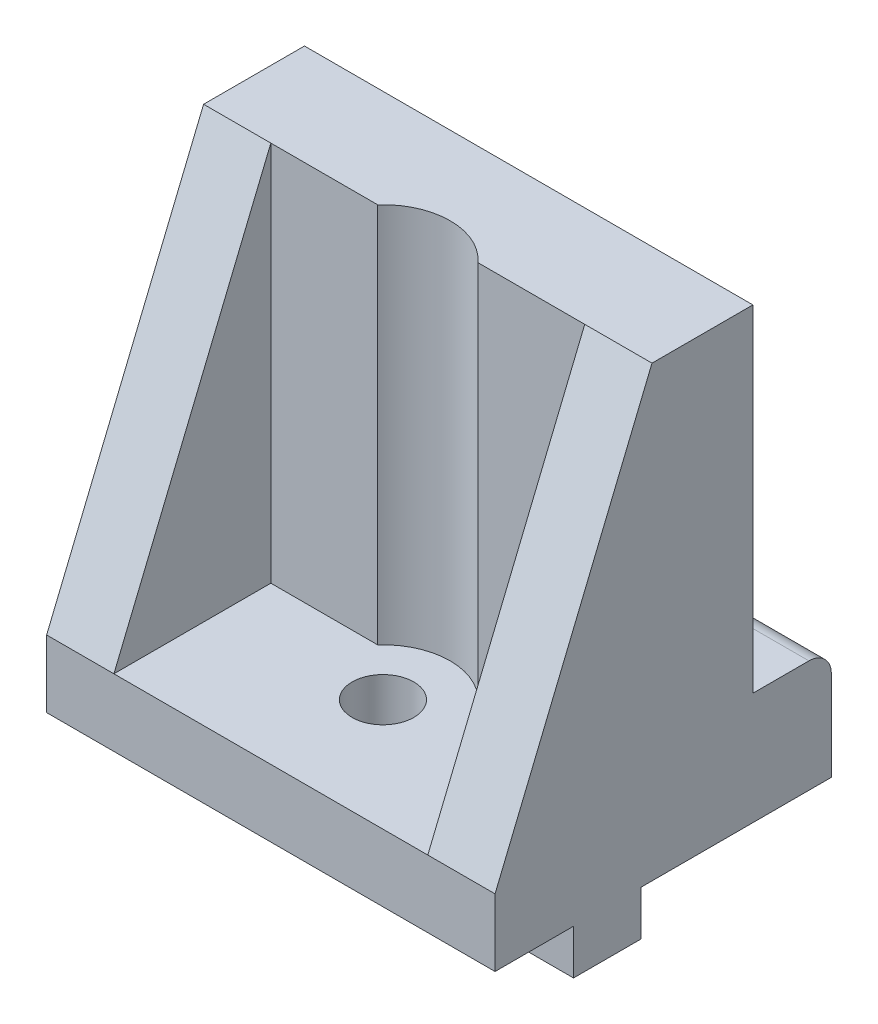
ISO-10303-21;
HEADER;
FILE_DESCRIPTION(('STEP AP214'),'2;1');
FILE_NAME('part.step','',(''),(''),'','','');
FILE_SCHEMA(('AUTOMOTIVE_DESIGN { 1 0 10303 214 1 1 1 1 }'));
ENDSEC;
DATA;
#1=APPLICATION_CONTEXT('core data for automotive mechanical design processes');
#2=APPLICATION_PROTOCOL_DEFINITION('international standard','automotive_design',2000,#1);
#3=PRODUCT_CONTEXT('',#1,'mechanical');
#4=PRODUCT('Part','Part','',(#3));
#5=PRODUCT_RELATED_PRODUCT_CATEGORY('part','',(#4));
#6=PRODUCT_DEFINITION_FORMATION('','',#4);
#7=PRODUCT_DEFINITION_CONTEXT('part definition',#1,'design');
#8=PRODUCT_DEFINITION('design','',#6,#7);
#9=PRODUCT_DEFINITION_SHAPE('','',#8);
#10=(LENGTH_UNIT() NAMED_UNIT(*) SI_UNIT(.MILLI.,.METRE.));
#11=(NAMED_UNIT(*) PLANE_ANGLE_UNIT() SI_UNIT($,.RADIAN.));
#12=(NAMED_UNIT(*) SI_UNIT($,.STERADIAN.) SOLID_ANGLE_UNIT());
#13=UNCERTAINTY_MEASURE_WITH_UNIT(LENGTH_MEASURE(1.E-05),#10,'distance_accuracy_value','');
#14=(GEOMETRIC_REPRESENTATION_CONTEXT(3) GLOBAL_UNCERTAINTY_ASSIGNED_CONTEXT((#13)) GLOBAL_UNIT_ASSIGNED_CONTEXT((#10,
#11,#12)) REPRESENTATION_CONTEXT('',''));
#15=CARTESIAN_POINT('',(0.,0.,0.));
#16=DIRECTION('',(0.,0.,1.));
#17=DIRECTION('',(1.,0.,0.));
#18=AXIS2_PLACEMENT_3D('',#15,#16,#17);
#19=CARTESIAN_POINT('',(6.,-34.,6.));
#20=DIRECTION('',(0.,0.,-1.));
#21=DIRECTION('',(-1.,0.,0.));
#22=AXIS2_PLACEMENT_3D('',#19,#20,#21);
#23=PLANE('',#22);
#24=DIRECTION('',(0.,-1.,0.));
#25=VECTOR('',#24,1.);
#26=CARTESIAN_POINT('',(24.4721359549996,16.9705627484771,6.));
#27=LINE('',#26,#25);
#28=CARTESIAN_POINT('',(24.4721359549996,-34.,6.));
#29=VERTEX_POINT('',#28);
#30=CARTESIAN_POINT('',(24.4721359549996,0.,6.));
#31=VERTEX_POINT('',#30);
#32=EDGE_CURVE('E272',#29,#31,#27,.F.);
#33=ORIENTED_EDGE('',*,*,#32,.F.);
#34=DIRECTION('',(-1.,0.,0.));
#35=VECTOR('',#34,1.);
#36=CARTESIAN_POINT('',(6.,-34.,6.));
#37=LINE('',#36,#35);
#38=CARTESIAN_POINT('',(34.,-34.,6.));
#39=VERTEX_POINT('',#38);
#40=EDGE_CURVE('E332',#39,#29,#37,.T.);
#41=ORIENTED_EDGE('',*,*,#40,.F.);
#42=DIRECTION('',(0.,1.,0.));
#43=VECTOR('',#42,1.);
#44=CARTESIAN_POINT('',(34.,-34.,6.));
#45=LINE('',#44,#43);
#46=CARTESIAN_POINT('',(34.,0.,6.));
#47=VERTEX_POINT('',#46);
#48=EDGE_CURVE('E335',#39,#47,#45,.T.);
#49=ORIENTED_EDGE('',*,*,#48,.T.);
#50=DIRECTION('',(-1.,0.,0.));
#51=VECTOR('',#50,1.);
#52=CARTESIAN_POINT('',(6.,0.,6.));
#53=LINE('',#52,#51);
#54=EDGE_CURVE('E325',#47,#31,#53,.T.);
#55=ORIENTED_EDGE('',*,*,#54,.T.);
#56=EDGE_LOOP('',(#33,#41,#49,#55));
#57=FACE_BOUND('',#56,.T.);
#58=ADVANCED_FACE('F39',(#57),#23,.F.);
#59=DIRECTION('',(0.,-1.,0.));
#60=VECTOR('',#59,1.);
#61=CARTESIAN_POINT('',(15.5278640450004,16.9705627484771,6.));
#62=LINE('',#61,#60);
#63=CARTESIAN_POINT('',(15.5278640450004,0.,6.));
#64=VERTEX_POINT('',#63);
#65=CARTESIAN_POINT('',(15.5278640450004,-34.,6.));
#66=VERTEX_POINT('',#65);
#67=EDGE_CURVE('E270',#64,#66,#62,.T.);
#68=ORIENTED_EDGE('',*,*,#67,.F.);
#69=CARTESIAN_POINT('',(6.00000000000003,0.,6.));
#70=VERTEX_POINT('',#69);
#71=EDGE_CURVE('E320',#64,#70,#53,.T.);
#72=ORIENTED_EDGE('',*,*,#71,.T.);
#73=DIRECTION('',(0.,1.,0.));
#74=VECTOR('',#73,1.);
#75=CARTESIAN_POINT('',(6.,-34.,6.));
#76=LINE('',#75,#74);
#77=CARTESIAN_POINT('',(6.,-34.,6.));
#78=VERTEX_POINT('',#77);
#79=EDGE_CURVE('E338',#78,#70,#76,.T.);
#80=ORIENTED_EDGE('',*,*,#79,.F.);
#81=EDGE_CURVE('E331',#66,#78,#37,.T.);
#82=ORIENTED_EDGE('',*,*,#81,.F.);
#83=EDGE_LOOP('',(#68,#72,#80,#82));
#84=FACE_BOUND('',#83,.T.);
#85=ADVANCED_FACE('F432',(#84),#23,.F.);
#86=CARTESIAN_POINT('',(0.,-40.,20.));
#87=DIRECTION('',(0.,1.,0.));
#88=DIRECTION('',(0.,0.,1.));
#89=AXIS2_PLACEMENT_3D('',#86,#87,#88);
#90=PLANE('',#89);
#91=DIRECTION('',(-1.,0.,0.));
#92=VECTOR('',#91,1.);
#93=CARTESIAN_POINT('',(0.,-40.,13.));
#94=LINE('',#93,#92);
#95=CARTESIAN_POINT('',(40.,-40.,13.));
#96=VERTEX_POINT('',#95);
#97=CARTESIAN_POINT('',(0.,-40.,13.));
#98=VERTEX_POINT('',#97);
#99=EDGE_CURVE('E285',#96,#98,#94,.T.);
#100=ORIENTED_EDGE('',*,*,#99,.F.);
#101=DIRECTION('',(0.,0.,-1.));
#102=VECTOR('',#101,1.);
#103=CARTESIAN_POINT('',(40.,-40.,20.));
#104=LINE('',#103,#102);
#105=CARTESIAN_POINT('',(40.,-40.,20.));
#106=VERTEX_POINT('',#105);
#107=EDGE_CURVE('E351',#106,#96,#104,.T.);
#108=ORIENTED_EDGE('',*,*,#107,.F.);
#109=DIRECTION('',(1.,0.,0.));
#110=VECTOR('',#109,1.);
#111=CARTESIAN_POINT('',(0.,-40.,20.));
#112=LINE('',#111,#110);
#113=CARTESIAN_POINT('',(0.,-40.,20.));
#114=VERTEX_POINT('',#113);
#115=EDGE_CURVE('E345',#114,#106,#112,.T.);
#116=ORIENTED_EDGE('',*,*,#115,.F.);
#117=DIRECTION('',(0.,0.,-1.));
#118=VECTOR('',#117,1.);
#119=CARTESIAN_POINT('',(0.,-40.,20.));
#120=LINE('',#119,#118);
#121=EDGE_CURVE('E355',#114,#98,#120,.T.);
#122=ORIENTED_EDGE('',*,*,#121,.T.);
#123=EDGE_LOOP('',(#100,#108,#116,#122));
#124=FACE_BOUND('',#123,.T.);
#125=ADVANCED_FACE('F401',(#124),#90,.F.);
#126=DIRECTION('',(1.,0.,0.));
#127=VECTOR('',#126,1.);
#128=CARTESIAN_POINT('',(0.,-40.,7.));
#129=LINE('',#128,#127);
#130=CARTESIAN_POINT('',(0.,-40.,7.));
#131=VERTEX_POINT('',#130);
#132=CARTESIAN_POINT('',(40.,-40.,7.));
#133=VERTEX_POINT('',#132);
#134=EDGE_CURVE('E280',#131,#133,#129,.T.);
#135=ORIENTED_EDGE('',*,*,#134,.F.);
#136=CARTESIAN_POINT('',(0.,-40.,-10.));
#137=VERTEX_POINT('',#136);
#138=EDGE_CURVE('E354',#131,#137,#120,.T.);
#139=ORIENTED_EDGE('',*,*,#138,.T.);
#140=DIRECTION('',(-1.,0.,0.));
#141=VECTOR('',#140,1.);
#142=CARTESIAN_POINT('',(81.2310562561766,-40.,-10.));
#143=LINE('',#142,#141);
#144=CARTESIAN_POINT('',(40.,-40.,-10.));
#145=VERTEX_POINT('',#144);
#146=EDGE_CURVE('E228',#145,#137,#143,.T.);
#147=ORIENTED_EDGE('',*,*,#146,.F.);
#148=EDGE_CURVE('E350',#133,#145,#104,.T.);
#149=ORIENTED_EDGE('',*,*,#148,.F.);
#150=EDGE_LOOP('',(#135,#139,#147,#149));
#151=FACE_BOUND('',#150,.T.);
#152=ADVANCED_FACE('F417',(#151),#90,.F.);
#153=CARTESIAN_POINT('',(0.,0.,20.));
#154=DIRECTION('',(1.,0.,0.));
#155=DIRECTION('',(0.,1.,0.));
#156=AXIS2_PLACEMENT_3D('',#153,#154,#155);
#157=PLANE('',#156);
#158=DIRECTION('',(0.,0.,-1.));
#159=VECTOR('',#158,1.);
#160=CARTESIAN_POINT('',(0.,-30.,-10.));
#161=LINE('',#160,#159);
#162=CARTESIAN_POINT('',(0.,-30.,-3.));
#163=VERTEX_POINT('',#162);
#164=CARTESIAN_POINT('',(0.,-30.,-8.));
#165=VERTEX_POINT('',#164);
#166=EDGE_CURVE('E220',#163,#165,#161,.T.);
#167=ORIENTED_EDGE('',*,*,#166,.T.);
#168=CARTESIAN_POINT('',(0.,-32.,-8.));
#169=DIRECTION('',(1.,0.,0.));
#170=DIRECTION('',(0.,1.,0.));
#171=AXIS2_PLACEMENT_3D('',#168,#169,#170);
#172=CIRCLE('',#171,2.);
#173=CARTESIAN_POINT('',(0.,-32.,-10.));
#174=VERTEX_POINT('',#173);
#175=EDGE_CURVE('E61',#165,#174,#172,.F.);
#176=ORIENTED_EDGE('',*,*,#175,.T.);
#177=DIRECTION('',(0.,-1.,0.));
#178=VECTOR('',#177,1.);
#179=CARTESIAN_POINT('',(0.,-40.,-10.));
#180=LINE('',#179,#178);
#181=EDGE_CURVE('E215',#174,#137,#180,.T.);
#182=ORIENTED_EDGE('',*,*,#181,.T.);
#183=ORIENTED_EDGE('',*,*,#138,.F.);
#184=DIRECTION('',(0.,1.,0.));
#185=VECTOR('',#184,1.);
#186=CARTESIAN_POINT('',(0.,-41.,7.));
#187=LINE('',#186,#185);
#188=CARTESIAN_POINT('',(0.,-44.,7.));
#189=VERTEX_POINT('',#188);
#190=EDGE_CURVE('E301',#189,#131,#187,.T.);
#191=ORIENTED_EDGE('',*,*,#190,.F.);
#192=DIRECTION('',(0.,0.,-1.));
#193=VECTOR('',#192,1.);
#194=CARTESIAN_POINT('',(0.,-44.,13.));
#195=LINE('',#194,#193);
#196=CARTESIAN_POINT('',(0.,-44.,13.));
#197=VERTEX_POINT('',#196);
#198=EDGE_CURVE('E233',#197,#189,#195,.T.);
#199=ORIENTED_EDGE('',*,*,#198,.F.);
#200=DIRECTION('',(0.,1.,0.));
#201=VECTOR('',#200,1.);
#202=CARTESIAN_POINT('',(0.,-41.,13.));
#203=LINE('',#202,#201);
#204=EDGE_CURVE('E288',#197,#98,#203,.T.);
#205=ORIENTED_EDGE('',*,*,#204,.T.);
#206=ORIENTED_EDGE('',*,*,#121,.F.);
#207=DIRECTION('',(0.,-1.,0.));
#208=VECTOR('',#207,1.);
#209=CARTESIAN_POINT('',(0.,0.,20.));
#210=LINE('',#209,#208);
#211=CARTESIAN_POINT('',(0.,-34.,20.));
#212=VERTEX_POINT('',#211);
#213=EDGE_CURVE('E341',#212,#114,#210,.T.);
#214=ORIENTED_EDGE('',*,*,#213,.F.);
#215=DIRECTION('',(0.,-0.924678098474716,0.380749805254295));
#216=VECTOR('',#215,1.);
#217=CARTESIAN_POINT('',(0.,-34.,20.));
#218=LINE('',#217,#216);
#219=CARTESIAN_POINT('',(0.,0.,6.));
#220=VERTEX_POINT('',#219);
#221=EDGE_CURVE('E199',#220,#212,#218,.T.);
#222=ORIENTED_EDGE('',*,*,#221,.F.);
#223=DIRECTION('',(0.,0.,-1.));
#224=VECTOR('',#223,1.);
#225=CARTESIAN_POINT('',(0.,0.,20.));
#226=LINE('',#225,#224);
#227=CARTESIAN_POINT('',(0.,0.,-3.));
#228=VERTEX_POINT('',#227);
#229=EDGE_CURVE('E193',#220,#228,#226,.T.);
#230=ORIENTED_EDGE('',*,*,#229,.T.);
#231=DIRECTION('',(0.,-1.,0.));
#232=VECTOR('',#231,1.);
#233=CARTESIAN_POINT('',(0.,-30.,-3.));
#234=LINE('',#233,#232);
#235=EDGE_CURVE('E197',#228,#163,#234,.T.);
#236=ORIENTED_EDGE('',*,*,#235,.T.);
#237=EDGE_LOOP('',(#167,#176,#182,#183,#191,#199,#205,#206,#214,#222,#230,#236));
#238=FACE_BOUND('',#237,.T.);
#239=ADVANCED_FACE('F195',(#238),#157,.F.);
#240=CARTESIAN_POINT('',(40.,0.,20.));
#241=DIRECTION('',(-1.,0.,0.));
#242=DIRECTION('',(0.,-1.,0.));
#243=AXIS2_PLACEMENT_3D('',#240,#241,#242);
#244=PLANE('',#243);
#245=DIRECTION('',(0.,1.,0.));
#246=VECTOR('',#245,1.);
#247=CARTESIAN_POINT('',(40.,-40.,-10.));
#248=LINE('',#247,#246);
#249=CARTESIAN_POINT('',(40.,-32.,-10.));
#250=VERTEX_POINT('',#249);
#251=EDGE_CURVE('E224',#145,#250,#248,.T.);
#252=ORIENTED_EDGE('',*,*,#251,.T.);
#253=CARTESIAN_POINT('',(40.,-32.,-8.));
#254=DIRECTION('',(-1.,0.,0.));
#255=DIRECTION('',(0.,-1.,0.));
#256=AXIS2_PLACEMENT_3D('',#253,#254,#255);
#257=CIRCLE('',#256,2.);
#258=CARTESIAN_POINT('',(40.,-30.,-8.));
#259=VERTEX_POINT('',#258);
#260=EDGE_CURVE('E11',#250,#259,#257,.F.);
#261=ORIENTED_EDGE('',*,*,#260,.T.);
#262=DIRECTION('',(0.,0.,1.));
#263=VECTOR('',#262,1.);
#264=CARTESIAN_POINT('',(40.,-30.,-10.));
#265=LINE('',#264,#263);
#266=CARTESIAN_POINT('',(40.,-30.,-3.));
#267=VERTEX_POINT('',#266);
#268=EDGE_CURVE('E382',#259,#267,#265,.T.);
#269=ORIENTED_EDGE('',*,*,#268,.T.);
#270=DIRECTION('',(0.,1.,0.));
#271=VECTOR('',#270,1.);
#272=CARTESIAN_POINT('',(40.,-30.,-3.));
#273=LINE('',#272,#271);
#274=CARTESIAN_POINT('',(40.,0.,-3.));
#275=VERTEX_POINT('',#274);
#276=EDGE_CURVE('E231',#267,#275,#273,.T.);
#277=ORIENTED_EDGE('',*,*,#276,.T.);
#278=DIRECTION('',(0.,0.,-1.));
#279=VECTOR('',#278,1.);
#280=CARTESIAN_POINT('',(40.,0.,20.));
#281=LINE('',#280,#279);
#282=CARTESIAN_POINT('',(40.,0.,5.99999999999999));
#283=VERTEX_POINT('',#282);
#284=EDGE_CURVE('E202',#283,#275,#281,.T.);
#285=ORIENTED_EDGE('',*,*,#284,.F.);
#286=DIRECTION('',(0.,0.924678098474716,-0.380749805254295));
#287=VECTOR('',#286,1.);
#288=CARTESIAN_POINT('',(40.,-34.,20.));
#289=LINE('',#288,#287);
#290=CARTESIAN_POINT('',(40.,-34.,20.));
#291=VERTEX_POINT('',#290);
#292=EDGE_CURVE('E309',#291,#283,#289,.T.);
#293=ORIENTED_EDGE('',*,*,#292,.F.);
#294=DIRECTION('',(0.,1.,0.));
#295=VECTOR('',#294,1.);
#296=CARTESIAN_POINT('',(40.,0.,20.));
#297=LINE('',#296,#295);
#298=EDGE_CURVE('E203',#106,#291,#297,.T.);
#299=ORIENTED_EDGE('',*,*,#298,.F.);
#300=ORIENTED_EDGE('',*,*,#107,.T.);
#301=DIRECTION('',(0.,1.,0.));
#302=VECTOR('',#301,1.);
#303=CARTESIAN_POINT('',(40.,-41.,13.));
#304=LINE('',#303,#302);
#305=CARTESIAN_POINT('',(40.,-44.,13.));
#306=VERTEX_POINT('',#305);
#307=EDGE_CURVE('E295',#306,#96,#304,.T.);
#308=ORIENTED_EDGE('',*,*,#307,.F.);
#309=DIRECTION('',(0.,0.,1.));
#310=VECTOR('',#309,1.);
#311=CARTESIAN_POINT('',(40.,-44.,13.));
#312=LINE('',#311,#310);
#313=CARTESIAN_POINT('',(40.,-44.,7.));
#314=VERTEX_POINT('',#313);
#315=EDGE_CURVE('E237',#314,#306,#312,.T.);
#316=ORIENTED_EDGE('',*,*,#315,.F.);
#317=DIRECTION('',(0.,1.,0.));
#318=VECTOR('',#317,1.);
#319=CARTESIAN_POINT('',(40.,-41.,7.));
#320=LINE('',#319,#318);
#321=EDGE_CURVE('E298',#314,#133,#320,.T.);
#322=ORIENTED_EDGE('',*,*,#321,.T.);
#323=ORIENTED_EDGE('',*,*,#148,.T.);
#324=EDGE_LOOP('',(#252,#261,#269,#277,#285,#293,#299,#300,#308,#316,#322,#323));
#325=FACE_BOUND('',#324,.T.);
#326=ADVANCED_FACE('F386',(#325),#244,.F.);
#327=CARTESIAN_POINT('',(0.,0.,20.));
#328=DIRECTION('',(0.,-1.,0.));
#329=DIRECTION('',(0.,0.,-1.));
#330=AXIS2_PLACEMENT_3D('',#327,#328,#329);
#331=PLANE('',#330);
#332=CARTESIAN_POINT('',(20.,0.,10.));
#333=DIRECTION('',(0.,-1.,0.));
#334=DIRECTION('',(0.,0.,-1.));
#335=AXIS2_PLACEMENT_3D('',#332,#333,#334);
#336=CIRCLE('',#335,6.);
#337=EDGE_CURVE('E268',#64,#31,#336,.T.);
#338=ORIENTED_EDGE('',*,*,#337,.T.);
#339=ORIENTED_EDGE('',*,*,#54,.F.);
#340=DIRECTION('',(-1.,0.,0.));
#341=VECTOR('',#340,1.);
#342=CARTESIAN_POINT('',(76.7695526217005,0.,6.));
#343=LINE('',#342,#341);
#344=EDGE_CURVE('E311',#283,#47,#343,.T.);
#345=ORIENTED_EDGE('',*,*,#344,.F.);
#346=ORIENTED_EDGE('',*,*,#284,.T.);
#347=DIRECTION('',(-1.,0.,0.));
#348=VECTOR('',#347,1.);
#349=CARTESIAN_POINT('',(81.2310562561766,0.,-3.));
#350=LINE('',#349,#348);
#351=EDGE_CURVE('E206',#275,#228,#350,.T.);
#352=ORIENTED_EDGE('',*,*,#351,.T.);
#353=ORIENTED_EDGE('',*,*,#229,.F.);
#354=EDGE_CURVE('E305',#70,#220,#343,.T.);
#355=ORIENTED_EDGE('',*,*,#354,.F.);
#356=ORIENTED_EDGE('',*,*,#71,.F.);
#357=EDGE_LOOP('',(#338,#339,#345,#346,#352,#353,#355,#356));
#358=FACE_BOUND('',#357,.T.);
#359=ADVANCED_FACE('F208',(#358),#331,.F.);
#360=CARTESIAN_POINT('',(0.,0.,20.));
#361=DIRECTION('',(0.,0.,1.));
#362=DIRECTION('',(1.,0.,0.));
#363=AXIS2_PLACEMENT_3D('',#360,#361,#362);
#364=PLANE('',#363);
#365=DIRECTION('',(-1.,0.,0.));
#366=VECTOR('',#365,1.);
#367=CARTESIAN_POINT('',(76.7695526217005,-34.,20.));
#368=LINE('',#367,#366);
#369=CARTESIAN_POINT('',(6.,-34.,20.));
#370=VERTEX_POINT('',#369);
#371=EDGE_CURVE('E310',#370,#212,#368,.T.);
#372=ORIENTED_EDGE('',*,*,#371,.T.);
#373=ORIENTED_EDGE('',*,*,#213,.T.);
#374=ORIENTED_EDGE('',*,*,#115,.T.);
#375=ORIENTED_EDGE('',*,*,#298,.T.);
#376=CARTESIAN_POINT('',(34.,-34.,20.));
#377=VERTEX_POINT('',#376);
#378=EDGE_CURVE('E306',#291,#377,#368,.T.);
#379=ORIENTED_EDGE('',*,*,#378,.T.);
#380=DIRECTION('',(1.,0.,0.));
#381=VECTOR('',#380,1.);
#382=CARTESIAN_POINT('',(6.00000000000001,-34.,20.));
#383=LINE('',#382,#381);
#384=EDGE_CURVE('E324',#370,#377,#383,.T.);
#385=ORIENTED_EDGE('',*,*,#384,.F.);
#386=EDGE_LOOP('',(#372,#373,#374,#375,#379,#385));
#387=FACE_BOUND('',#386,.T.);
#388=ADVANCED_FACE('F394',(#387),#364,.T.);
#389=CARTESIAN_POINT('',(6.00000000000001,-34.,20.));
#390=DIRECTION('',(-1.,0.,0.));
#391=DIRECTION('',(0.,0.,1.));
#392=AXIS2_PLACEMENT_3D('',#389,#390,#391);
#393=PLANE('',#392);
#394=ORIENTED_EDGE('',*,*,#79,.T.);
#395=DIRECTION('',(0.,-0.924678098474716,0.380749805254295));
#396=VECTOR('',#395,1.);
#397=CARTESIAN_POINT('',(6.00000000000001,-34.,20.));
#398=LINE('',#397,#396);
#399=EDGE_CURVE('E317',#70,#370,#398,.T.);
#400=ORIENTED_EDGE('',*,*,#399,.T.);
#401=DIRECTION('',(0.,0.,1.));
#402=VECTOR('',#401,1.);
#403=CARTESIAN_POINT('',(6.00000000000001,-34.,20.));
#404=LINE('',#403,#402);
#405=EDGE_CURVE('E321',#78,#370,#404,.T.);
#406=ORIENTED_EDGE('',*,*,#405,.F.);
#407=EDGE_LOOP('',(#394,#400,#406));
#408=FACE_BOUND('',#407,.T.);
#409=ADVANCED_FACE('F448',(#408),#393,.F.);
#410=CARTESIAN_POINT('',(34.,-34.,20.));
#411=DIRECTION('',(1.,0.,0.));
#412=DIRECTION('',(0.,0.,-1.));
#413=AXIS2_PLACEMENT_3D('',#410,#411,#412);
#414=PLANE('',#413);
#415=DIRECTION('',(0.,0.,-1.));
#416=VECTOR('',#415,1.);
#417=CARTESIAN_POINT('',(34.,-34.,20.));
#418=LINE('',#417,#416);
#419=EDGE_CURVE('E328',#377,#39,#418,.T.);
#420=ORIENTED_EDGE('',*,*,#419,.F.);
#421=DIRECTION('',(0.,0.924678098474716,-0.380749805254295));
#422=VECTOR('',#421,1.);
#423=CARTESIAN_POINT('',(34.,-34.,20.));
#424=LINE('',#423,#422);
#425=EDGE_CURVE('E314',#377,#47,#424,.T.);
#426=ORIENTED_EDGE('',*,*,#425,.T.);
#427=ORIENTED_EDGE('',*,*,#48,.F.);
#428=EDGE_LOOP('',(#420,#426,#427));
#429=FACE_BOUND('',#428,.T.);
#430=ADVANCED_FACE('F445',(#429),#414,.F.);
#431=CARTESIAN_POINT('',(0.,-34.,0.));
#432=DIRECTION('',(0.,-1.,0.));
#433=DIRECTION('',(0.,0.,-1.));
#434=AXIS2_PLACEMENT_3D('',#431,#432,#433);
#435=PLANE('',#434);
#436=ORIENTED_EDGE('',*,*,#40,.T.);
#437=CARTESIAN_POINT('',(20.,-34.,10.));
#438=DIRECTION('',(0.,1.,0.));
#439=DIRECTION('',(0.,0.,1.));
#440=AXIS2_PLACEMENT_3D('',#437,#438,#439);
#441=CIRCLE('',#440,6.);
#442=EDGE_CURVE('E250',#29,#66,#441,.T.);
#443=ORIENTED_EDGE('',*,*,#442,.T.);
#444=ORIENTED_EDGE('',*,*,#81,.T.);
#445=ORIENTED_EDGE('',*,*,#405,.T.);
#446=ORIENTED_EDGE('',*,*,#384,.T.);
#447=ORIENTED_EDGE('',*,*,#419,.T.);
#448=EDGE_LOOP('',(#436,#443,#444,#445,#446,#447));
#449=FACE_BOUND('',#448,.T.);
#450=CARTESIAN_POINT('',(20.,-34.,10.));
#451=DIRECTION('',(0.,-1.,0.));
#452=DIRECTION('',(0.,0.,-1.));
#453=AXIS2_PLACEMENT_3D('',#450,#451,#452);
#454=CIRCLE('',#453,2.75);
#455=CARTESIAN_POINT('',(20.,-34.,7.25));
#456=VERTEX_POINT('',#455);
#457=EDGE_CURVE('E277',#456,#456,#454,.F.);
#458=ORIENTED_EDGE('',*,*,#457,.F.);
#459=EDGE_LOOP('',(#458));
#460=FACE_BOUND('',#459,.T.);
#461=ADVANCED_FACE('F443',(#449,#460),#435,.F.);
#462=CARTESIAN_POINT('',(76.7695526217005,-34.,20.));
#463=DIRECTION('',(0.,-0.380749805254295,-0.924678098474716));
#464=DIRECTION('',(0.,0.924678098474716,-0.380749805254295));
#465=AXIS2_PLACEMENT_3D('',#462,#463,#464);
#466=PLANE('',#465);
#467=ORIENTED_EDGE('',*,*,#378,.F.);
#468=ORIENTED_EDGE('',*,*,#292,.T.);
#469=ORIENTED_EDGE('',*,*,#344,.T.);
#470=ORIENTED_EDGE('',*,*,#425,.F.);
#471=EDGE_LOOP('',(#467,#468,#469,#470));
#472=FACE_BOUND('',#471,.T.);
#473=ADVANCED_FACE('F514',(#472),#466,.F.);
#474=ORIENTED_EDGE('',*,*,#354,.T.);
#475=ORIENTED_EDGE('',*,*,#221,.T.);
#476=ORIENTED_EDGE('',*,*,#371,.F.);
#477=ORIENTED_EDGE('',*,*,#399,.F.);
#478=EDGE_LOOP('',(#474,#475,#476,#477));
#479=FACE_BOUND('',#478,.T.);
#480=ADVANCED_FACE('F512',(#479),#466,.F.);
#481=CARTESIAN_POINT('',(0.,-41.,7.));
#482=DIRECTION('',(0.,0.,1.));
#483=DIRECTION('',(1.,0.,0.));
#484=AXIS2_PLACEMENT_3D('',#481,#482,#483);
#485=PLANE('',#484);
#486=ORIENTED_EDGE('',*,*,#134,.T.);
#487=ORIENTED_EDGE('',*,*,#321,.F.);
#488=DIRECTION('',(1.,0.,0.));
#489=VECTOR('',#488,1.);
#490=CARTESIAN_POINT('',(40.,-44.,7.));
#491=LINE('',#490,#489);
#492=CARTESIAN_POINT('',(30.,-44.,7.));
#493=VERTEX_POINT('',#492);
#494=EDGE_CURVE('E257',#493,#314,#491,.T.);
#495=ORIENTED_EDGE('',*,*,#494,.F.);
#496=DIRECTION('',(0.,1.,0.));
#497=VECTOR('',#496,1.);
#498=CARTESIAN_POINT('',(30.,-44.,7.));
#499=LINE('',#498,#497);
#500=CARTESIAN_POINT('',(30.,-43.,7.));
#501=VERTEX_POINT('',#500);
#502=EDGE_CURVE('E254',#493,#501,#499,.T.);
#503=ORIENTED_EDGE('',*,*,#502,.T.);
#504=CARTESIAN_POINT('',(28.,-43.,7.));
#505=DIRECTION('',(0.,0.,1.));
#506=DIRECTION('',(1.,0.,0.));
#507=AXIS2_PLACEMENT_3D('',#504,#505,#506);
#508=CIRCLE('',#507,2.);
#509=CARTESIAN_POINT('',(28.,-41.,7.));
#510=VERTEX_POINT('',#509);
#511=EDGE_CURVE('E367',#501,#510,#508,.T.);
#512=ORIENTED_EDGE('',*,*,#511,.T.);
#513=DIRECTION('',(1.,0.,0.));
#514=VECTOR('',#513,1.);
#515=CARTESIAN_POINT('',(0.,-41.,7.));
#516=LINE('',#515,#514);
#517=CARTESIAN_POINT('',(12.,-41.,7.));
#518=VERTEX_POINT('',#517);
#519=EDGE_CURVE('E281',#518,#510,#516,.T.);
#520=ORIENTED_EDGE('',*,*,#519,.F.);
#521=CARTESIAN_POINT('',(12.,-43.,7.));
#522=DIRECTION('',(0.,0.,1.));
#523=DIRECTION('',(1.,0.,0.));
#524=AXIS2_PLACEMENT_3D('',#521,#522,#523);
#525=CIRCLE('',#524,2.);
#526=CARTESIAN_POINT('',(10.,-43.,7.));
#527=VERTEX_POINT('',#526);
#528=EDGE_CURVE('E373',#518,#527,#525,.T.);
#529=ORIENTED_EDGE('',*,*,#528,.T.);
#530=DIRECTION('',(0.,1.,0.));
#531=VECTOR('',#530,1.);
#532=CARTESIAN_POINT('',(10.,-44.,7.));
#533=LINE('',#532,#531);
#534=CARTESIAN_POINT('',(10.,-44.,7.));
#535=VERTEX_POINT('',#534);
#536=EDGE_CURVE('E247',#535,#527,#533,.T.);
#537=ORIENTED_EDGE('',*,*,#536,.F.);
#538=DIRECTION('',(1.,0.,0.));
#539=VECTOR('',#538,1.);
#540=CARTESIAN_POINT('',(0.,-44.,7.));
#541=LINE('',#540,#539);
#542=EDGE_CURVE('E236',#189,#535,#541,.T.);
#543=ORIENTED_EDGE('',*,*,#542,.F.);
#544=ORIENTED_EDGE('',*,*,#190,.T.);
#545=EDGE_LOOP('',(#486,#487,#495,#503,#512,#520,#529,#537,#543,#544));
#546=FACE_BOUND('',#545,.T.);
#547=ADVANCED_FACE('F412',(#546),#485,.F.);
#548=CARTESIAN_POINT('',(0.,-41.,13.));
#549=DIRECTION('',(0.,0.,-1.));
#550=DIRECTION('',(-1.,0.,0.));
#551=AXIS2_PLACEMENT_3D('',#548,#549,#550);
#552=PLANE('',#551);
#553=ORIENTED_EDGE('',*,*,#99,.T.);
#554=ORIENTED_EDGE('',*,*,#204,.F.);
#555=DIRECTION('',(-1.,0.,0.));
#556=VECTOR('',#555,1.);
#557=CARTESIAN_POINT('',(0.,-44.,13.));
#558=LINE('',#557,#556);
#559=CARTESIAN_POINT('',(10.,-44.,13.));
#560=VERTEX_POINT('',#559);
#561=EDGE_CURVE('E241',#560,#197,#558,.T.);
#562=ORIENTED_EDGE('',*,*,#561,.F.);
#563=DIRECTION('',(0.,1.,0.));
#564=VECTOR('',#563,1.);
#565=CARTESIAN_POINT('',(10.,-44.,13.));
#566=LINE('',#565,#564);
#567=CARTESIAN_POINT('',(10.,-43.,13.));
#568=VERTEX_POINT('',#567);
#569=EDGE_CURVE('E244',#560,#568,#566,.T.);
#570=ORIENTED_EDGE('',*,*,#569,.T.);
#571=CARTESIAN_POINT('',(12.,-43.,13.));
#572=DIRECTION('',(0.,0.,-1.));
#573=DIRECTION('',(-1.,0.,0.));
#574=AXIS2_PLACEMENT_3D('',#571,#572,#573);
#575=CIRCLE('',#574,2.);
#576=CARTESIAN_POINT('',(12.,-41.,13.));
#577=VERTEX_POINT('',#576);
#578=EDGE_CURVE('E371',#568,#577,#575,.T.);
#579=ORIENTED_EDGE('',*,*,#578,.T.);
#580=DIRECTION('',(-1.,0.,0.));
#581=VECTOR('',#580,1.);
#582=CARTESIAN_POINT('',(0.,-41.,13.));
#583=LINE('',#582,#581);
#584=CARTESIAN_POINT('',(28.,-41.,13.));
#585=VERTEX_POINT('',#584);
#586=EDGE_CURVE('E284',#585,#577,#583,.T.);
#587=ORIENTED_EDGE('',*,*,#586,.F.);
#588=CARTESIAN_POINT('',(28.,-43.,13.));
#589=DIRECTION('',(0.,0.,-1.));
#590=DIRECTION('',(-1.,0.,0.));
#591=AXIS2_PLACEMENT_3D('',#588,#589,#590);
#592=CIRCLE('',#591,2.);
#593=CARTESIAN_POINT('',(30.,-43.,13.));
#594=VERTEX_POINT('',#593);
#595=EDGE_CURVE('E369',#585,#594,#592,.T.);
#596=ORIENTED_EDGE('',*,*,#595,.T.);
#597=DIRECTION('',(0.,1.,0.));
#598=VECTOR('',#597,1.);
#599=CARTESIAN_POINT('',(30.,-44.,13.));
#600=LINE('',#599,#598);
#601=CARTESIAN_POINT('',(30.,-44.,13.));
#602=VERTEX_POINT('',#601);
#603=EDGE_CURVE('E251',#602,#594,#600,.T.);
#604=ORIENTED_EDGE('',*,*,#603,.F.);
#605=DIRECTION('',(-1.,0.,0.));
#606=VECTOR('',#605,1.);
#607=CARTESIAN_POINT('',(40.,-44.,13.));
#608=LINE('',#607,#606);
#609=EDGE_CURVE('E262',#306,#602,#608,.T.);
#610=ORIENTED_EDGE('',*,*,#609,.F.);
#611=ORIENTED_EDGE('',*,*,#307,.T.);
#612=EDGE_LOOP('',(#553,#554,#562,#570,#579,#587,#596,#604,#610,#611));
#613=FACE_BOUND('',#612,.T.);
#614=ADVANCED_FACE('F405',(#613),#552,.F.);
#615=CARTESIAN_POINT('',(0.,-41.,0.));
#616=DIRECTION('',(0.,-1.,0.));
#617=DIRECTION('',(0.,0.,-1.));
#618=AXIS2_PLACEMENT_3D('',#615,#616,#617);
#619=PLANE('',#618);
#620=ORIENTED_EDGE('',*,*,#519,.T.);
#621=DIRECTION('',(0.,0.,-1.));
#622=VECTOR('',#621,1.);
#623=CARTESIAN_POINT('',(28.,-41.,0.));
#624=LINE('',#623,#622);
#625=EDGE_CURVE('E362',#510,#585,#624,.F.);
#626=ORIENTED_EDGE('',*,*,#625,.T.);
#627=ORIENTED_EDGE('',*,*,#586,.T.);
#628=DIRECTION('',(0.,0.,1.));
#629=VECTOR('',#628,1.);
#630=CARTESIAN_POINT('',(12.,-41.,0.));
#631=LINE('',#630,#629);
#632=EDGE_CURVE('E360',#577,#518,#631,.F.);
#633=ORIENTED_EDGE('',*,*,#632,.T.);
#634=EDGE_LOOP('',(#620,#626,#627,#633));
#635=FACE_BOUND('',#634,.T.);
#636=CARTESIAN_POINT('',(20.,-41.,10.));
#637=DIRECTION('',(0.,-1.,0.));
#638=DIRECTION('',(0.,0.,-1.));
#639=AXIS2_PLACEMENT_3D('',#636,#637,#638);
#640=CIRCLE('',#639,2.75);
#641=CARTESIAN_POINT('',(20.,-41.,7.25));
#642=VERTEX_POINT('',#641);
#643=EDGE_CURVE('E274',#642,#642,#640,.T.);
#644=ORIENTED_EDGE('',*,*,#643,.F.);
#645=EDGE_LOOP('',(#644));
#646=FACE_BOUND('',#645,.T.);
#647=ADVANCED_FACE('F482',(#635,#646),#619,.T.);
#648=CARTESIAN_POINT('',(20.,-26.221825406948,10.));
#649=DIRECTION('',(0.,-1.,0.));
#650=DIRECTION('',(0.,0.,-1.));
#651=AXIS2_PLACEMENT_3D('',#648,#649,#650);
#652=CYLINDRICAL_SURFACE('',#651,2.75);
#653=ORIENTED_EDGE('',*,*,#457,.T.);
#654=EDGE_LOOP('',(#653));
#655=FACE_BOUND('',#654,.T.);
#656=ORIENTED_EDGE('',*,*,#643,.T.);
#657=EDGE_LOOP('',(#656));
#658=FACE_BOUND('',#657,.T.);
#659=ADVANCED_FACE('F503',(#655,#658),#652,.F.);
#660=CARTESIAN_POINT('',(20.,16.9705627484771,10.));
#661=DIRECTION('',(0.,-1.,0.));
#662=DIRECTION('',(0.,0.,-1.));
#663=AXIS2_PLACEMENT_3D('',#660,#661,#662);
#664=CYLINDRICAL_SURFACE('',#663,6.);
#665=ORIENTED_EDGE('',*,*,#32,.T.);
#666=ORIENTED_EDGE('',*,*,#337,.F.);
#667=ORIENTED_EDGE('',*,*,#67,.T.);
#668=ORIENTED_EDGE('',*,*,#442,.F.);
#669=EDGE_LOOP('',(#665,#666,#667,#668));
#670=FACE_BOUND('',#669,.T.);
#671=ADVANCED_FACE('F499',(#670),#664,.F.);
#672=CARTESIAN_POINT('',(30.,-44.,13.));
#673=DIRECTION('',(1.,0.,0.));
#674=DIRECTION('',(0.,0.,-1.));
#675=AXIS2_PLACEMENT_3D('',#672,#673,#674);
#676=PLANE('',#675);
#677=ORIENTED_EDGE('',*,*,#603,.T.);
#678=DIRECTION('',(0.,0.,-1.));
#679=VECTOR('',#678,1.);
#680=CARTESIAN_POINT('',(30.,-43.,13.));
#681=LINE('',#680,#679);
#682=EDGE_CURVE('E357',#594,#501,#681,.T.);
#683=ORIENTED_EDGE('',*,*,#682,.T.);
#684=ORIENTED_EDGE('',*,*,#502,.F.);
#685=DIRECTION('',(0.,0.,-1.));
#686=VECTOR('',#685,1.);
#687=CARTESIAN_POINT('',(30.,-44.,13.));
#688=LINE('',#687,#686);
#689=EDGE_CURVE('E260',#602,#493,#688,.T.);
#690=ORIENTED_EDGE('',*,*,#689,.F.);
#691=EDGE_LOOP('',(#677,#683,#684,#690));
#692=FACE_BOUND('',#691,.T.);
#693=ADVANCED_FACE('F477',(#692),#676,.F.);
#694=CARTESIAN_POINT('',(0.,-44.,0.));
#695=DIRECTION('',(0.,1.,0.));
#696=DIRECTION('',(0.,0.,1.));
#697=AXIS2_PLACEMENT_3D('',#694,#695,#696);
#698=PLANE('',#697);
#699=ORIENTED_EDGE('',*,*,#315,.T.);
#700=ORIENTED_EDGE('',*,*,#609,.T.);
#701=ORIENTED_EDGE('',*,*,#689,.T.);
#702=ORIENTED_EDGE('',*,*,#494,.T.);
#703=EDGE_LOOP('',(#699,#700,#701,#702));
#704=FACE_BOUND('',#703,.T.);
#705=ADVANCED_FACE('F409',(#704),#698,.F.);
#706=CARTESIAN_POINT('',(10.,-44.,13.));
#707=DIRECTION('',(-1.,0.,0.));
#708=DIRECTION('',(0.,0.,1.));
#709=AXIS2_PLACEMENT_3D('',#706,#707,#708);
#710=PLANE('',#709);
#711=ORIENTED_EDGE('',*,*,#536,.T.);
#712=DIRECTION('',(0.,0.,1.));
#713=VECTOR('',#712,1.);
#714=CARTESIAN_POINT('',(10.,-43.,13.));
#715=LINE('',#714,#713);
#716=EDGE_CURVE('E364',#527,#568,#715,.T.);
#717=ORIENTED_EDGE('',*,*,#716,.T.);
#718=ORIENTED_EDGE('',*,*,#569,.F.);
#719=DIRECTION('',(0.,0.,1.));
#720=VECTOR('',#719,1.);
#721=CARTESIAN_POINT('',(10.,-44.,13.));
#722=LINE('',#721,#720);
#723=EDGE_CURVE('E239',#535,#560,#722,.T.);
#724=ORIENTED_EDGE('',*,*,#723,.F.);
#725=EDGE_LOOP('',(#711,#717,#718,#724));
#726=FACE_BOUND('',#725,.T.);
#727=ADVANCED_FACE('F469',(#726),#710,.F.);
#728=CARTESIAN_POINT('',(0.,-44.,0.));
#729=DIRECTION('',(0.,-1.,0.));
#730=DIRECTION('',(0.,0.,-1.));
#731=AXIS2_PLACEMENT_3D('',#728,#729,#730);
#732=PLANE('',#731);
#733=ORIENTED_EDGE('',*,*,#198,.T.);
#734=ORIENTED_EDGE('',*,*,#542,.T.);
#735=ORIENTED_EDGE('',*,*,#723,.T.);
#736=ORIENTED_EDGE('',*,*,#561,.T.);
#737=EDGE_LOOP('',(#733,#734,#735,#736));
#738=FACE_BOUND('',#737,.T.);
#739=ADVANCED_FACE('F463',(#738),#732,.T.);
#740=CARTESIAN_POINT('',(28.,-43.,13.));
#741=DIRECTION('',(0.,0.,-1.));
#742=DIRECTION('',(-1.,0.,0.));
#743=AXIS2_PLACEMENT_3D('',#740,#741,#742);
#744=CYLINDRICAL_SURFACE('',#743,2.);
#745=ORIENTED_EDGE('',*,*,#595,.F.);
#746=ORIENTED_EDGE('',*,*,#625,.F.);
#747=ORIENTED_EDGE('',*,*,#511,.F.);
#748=ORIENTED_EDGE('',*,*,#682,.F.);
#749=EDGE_LOOP('',(#745,#746,#747,#748));
#750=FACE_BOUND('',#749,.T.);
#751=ADVANCED_FACE('F429',(#750),#744,.F.);
#752=CARTESIAN_POINT('',(12.,-43.,13.));
#753=DIRECTION('',(0.,0.,1.));
#754=DIRECTION('',(1.,0.,0.));
#755=AXIS2_PLACEMENT_3D('',#752,#753,#754);
#756=CYLINDRICAL_SURFACE('',#755,2.);
#757=ORIENTED_EDGE('',*,*,#528,.F.);
#758=ORIENTED_EDGE('',*,*,#632,.F.);
#759=ORIENTED_EDGE('',*,*,#578,.F.);
#760=ORIENTED_EDGE('',*,*,#716,.F.);
#761=EDGE_LOOP('',(#757,#758,#759,#760));
#762=FACE_BOUND('',#761,.T.);
#763=ADVANCED_FACE('F421',(#762),#756,.F.);
#764=CARTESIAN_POINT('',(81.2310562561766,-40.,-10.));
#765=DIRECTION('',(0.,0.,-1.));
#766=DIRECTION('',(-1.,0.,0.));
#767=AXIS2_PLACEMENT_3D('',#764,#765,#766);
#768=PLANE('',#767);
#769=ORIENTED_EDGE('',*,*,#181,.F.);
#770=DIRECTION('',(-1.,0.,0.));
#771=VECTOR('',#770,1.);
#772=CARTESIAN_POINT('',(81.2310562561766,-32.,-10.));
#773=LINE('',#772,#771);
#774=EDGE_CURVE('E47',#174,#250,#773,.F.);
#775=ORIENTED_EDGE('',*,*,#774,.T.);
#776=ORIENTED_EDGE('',*,*,#251,.F.);
#777=ORIENTED_EDGE('',*,*,#146,.T.);
#778=EDGE_LOOP('',(#769,#775,#776,#777));
#779=FACE_BOUND('',#778,.T.);
#780=ADVANCED_FACE('F419',(#779),#768,.T.);
#781=CARTESIAN_POINT('',(81.2310562561766,-30.,-10.));
#782=DIRECTION('',(0.,1.,0.));
#783=DIRECTION('',(-1.,0.,0.));
#784=AXIS2_PLACEMENT_3D('',#781,#782,#783);
#785=PLANE('',#784);
#786=ORIENTED_EDGE('',*,*,#268,.F.);
#787=DIRECTION('',(-1.,0.,0.));
#788=VECTOR('',#787,1.);
#789=CARTESIAN_POINT('',(81.2310562561766,-30.,-8.));
#790=LINE('',#789,#788);
#791=EDGE_CURVE('E375',#259,#165,#790,.T.);
#792=ORIENTED_EDGE('',*,*,#791,.T.);
#793=ORIENTED_EDGE('',*,*,#166,.F.);
#794=DIRECTION('',(-1.,0.,0.));
#795=VECTOR('',#794,1.);
#796=CARTESIAN_POINT('',(81.2310562561766,-30.,-3.));
#797=LINE('',#796,#795);
#798=EDGE_CURVE('E214',#267,#163,#797,.T.);
#799=ORIENTED_EDGE('',*,*,#798,.F.);
#800=EDGE_LOOP('',(#786,#792,#793,#799));
#801=FACE_BOUND('',#800,.T.);
#802=ADVANCED_FACE('F381',(#801),#785,.T.);
#803=CARTESIAN_POINT('',(81.2310562561766,-30.,-3.));
#804=DIRECTION('',(0.,0.,-1.));
#805=DIRECTION('',(0.,1.,0.));
#806=AXIS2_PLACEMENT_3D('',#803,#804,#805);
#807=PLANE('',#806);
#808=ORIENTED_EDGE('',*,*,#276,.F.);
#809=ORIENTED_EDGE('',*,*,#798,.T.);
#810=ORIENTED_EDGE('',*,*,#235,.F.);
#811=ORIENTED_EDGE('',*,*,#351,.F.);
#812=EDGE_LOOP('',(#808,#809,#810,#811));
#813=FACE_BOUND('',#812,.T.);
#814=ADVANCED_FACE('F217',(#813),#807,.T.);
#815=CARTESIAN_POINT('',(81.2310562561766,-32.,-8.));
#816=DIRECTION('',(-1.,0.,0.));
#817=DIRECTION('',(0.,-1.,0.));
#818=AXIS2_PLACEMENT_3D('',#815,#816,#817);
#819=CYLINDRICAL_SURFACE('',#818,2.);
#820=ORIENTED_EDGE('',*,*,#260,.F.);
#821=ORIENTED_EDGE('',*,*,#774,.F.);
#822=ORIENTED_EDGE('',*,*,#175,.F.);
#823=ORIENTED_EDGE('',*,*,#791,.F.);
#824=EDGE_LOOP('',(#820,#821,#822,#823));
#825=FACE_BOUND('',#824,.T.);
#826=ADVANCED_FACE('F41',(#825),#819,.T.);
#827=CLOSED_SHELL('',(#58,#85,#125,#152,#239,#326,#359,#388,#409,#430,#461,#473,#480,#547,#614,
#647,#659,#671,#693,#705,#727,#739,#751,#763,#780,#802,#814,#826));
#828=MANIFOLD_SOLID_BREP('B2',#827);
#829=ADVANCED_BREP_SHAPE_REPRESENTATION('',(#18,#828),#14);
#830=SHAPE_DEFINITION_REPRESENTATION(#9,#829);
ENDSEC;
END-ISO-10303-21;
